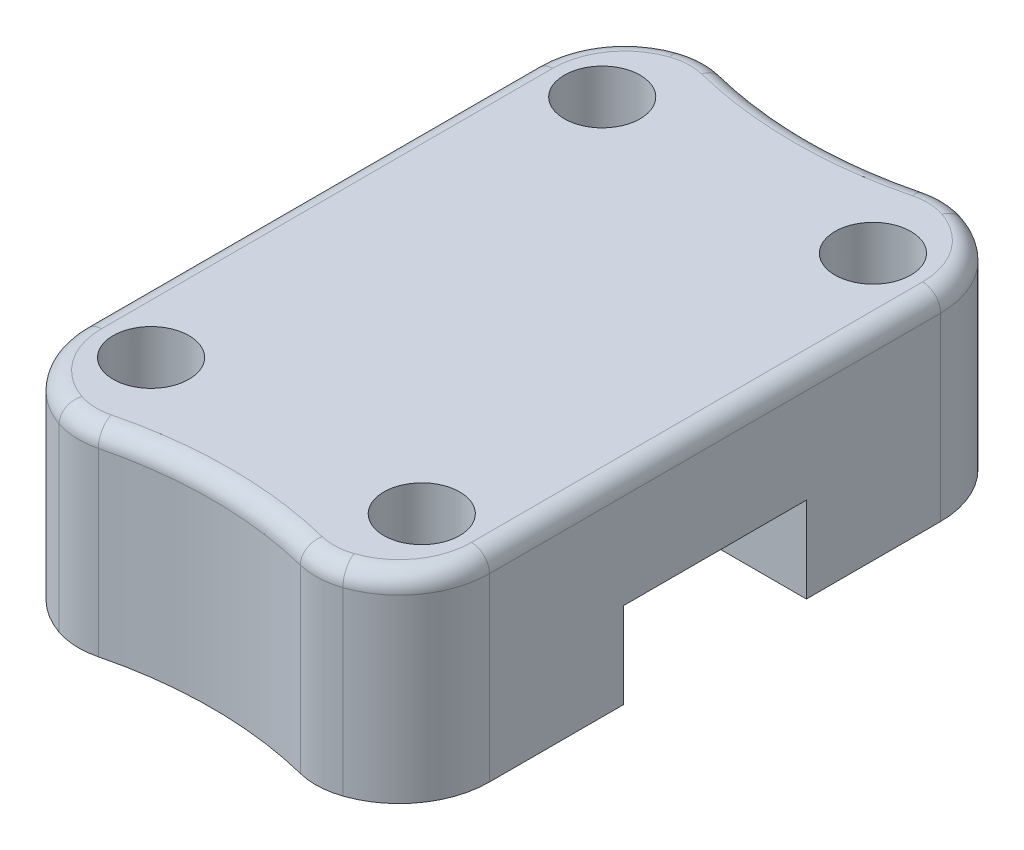
ISO-10303-21;
HEADER;
FILE_DESCRIPTION(('STEP AP214'),'2;1');
FILE_NAME('part.step','',(''),(''),'','','');
FILE_SCHEMA(('AUTOMOTIVE_DESIGN { 1 0 10303 214 1 1 1 1 }'));
ENDSEC;
DATA;
#1=APPLICATION_CONTEXT('core data for automotive mechanical design processes');
#2=APPLICATION_PROTOCOL_DEFINITION('international standard','automotive_design',2000,#1);
#3=PRODUCT_CONTEXT('',#1,'mechanical');
#4=PRODUCT('Part','Part','',(#3));
#5=PRODUCT_RELATED_PRODUCT_CATEGORY('part','',(#4));
#6=PRODUCT_DEFINITION_FORMATION('','',#4);
#7=PRODUCT_DEFINITION_CONTEXT('part definition',#1,'design');
#8=PRODUCT_DEFINITION('design','',#6,#7);
#9=PRODUCT_DEFINITION_SHAPE('','',#8);
#10=(LENGTH_UNIT() NAMED_UNIT(*) SI_UNIT(.MILLI.,.METRE.));
#11=(NAMED_UNIT(*) PLANE_ANGLE_UNIT() SI_UNIT($,.RADIAN.));
#12=(NAMED_UNIT(*) SI_UNIT($,.STERADIAN.) SOLID_ANGLE_UNIT());
#13=UNCERTAINTY_MEASURE_WITH_UNIT(LENGTH_MEASURE(1.E-05),#10,'distance_accuracy_value','');
#14=(GEOMETRIC_REPRESENTATION_CONTEXT(3) GLOBAL_UNCERTAINTY_ASSIGNED_CONTEXT((#13)) GLOBAL_UNIT_ASSIGNED_CONTEXT((#10,
#11,#12)) REPRESENTATION_CONTEXT('',''));
#15=CARTESIAN_POINT('',(0.,0.,0.));
#16=DIRECTION('',(0.,0.,1.));
#17=DIRECTION('',(1.,0.,0.));
#18=AXIS2_PLACEMENT_3D('',#15,#16,#17);
#19=CARTESIAN_POINT('',(0.,0.,0.));
#20=DIRECTION('',(0.,1.,0.));
#21=DIRECTION('',(0.,0.,1.));
#22=AXIS2_PLACEMENT_3D('',#19,#20,#21);
#23=PLANE('',#22);
#24=CARTESIAN_POINT('',(-15.,0.,25.));
#25=DIRECTION('',(0.,1.,0.));
#26=DIRECTION('',(0.,0.,1.));
#27=AXIS2_PLACEMENT_3D('',#24,#25,#26);
#28=CIRCLE('',#27,4.7);
#29=CARTESIAN_POINT('',(-15.,0.,29.7));
#30=VERTEX_POINT('',#29);
#31=EDGE_CURVE('E361',#30,#30,#28,.T.);
#32=ORIENTED_EDGE('',*,*,#31,.T.);
#33=EDGE_LOOP('',(#32));
#34=FACE_BOUND('',#33,.T.);
#35=CARTESIAN_POINT('',(15.,0.,25.));
#36=DIRECTION('',(0.,1.,0.));
#37=DIRECTION('',(0.,0.,1.));
#38=AXIS2_PLACEMENT_3D('',#35,#36,#37);
#39=CIRCLE('',#38,4.7);
#40=CARTESIAN_POINT('',(15.,0.,29.7));
#41=VERTEX_POINT('',#40);
#42=EDGE_CURVE('E358',#41,#41,#39,.T.);
#43=ORIENTED_EDGE('',*,*,#42,.T.);
#44=EDGE_LOOP('',(#43));
#45=FACE_BOUND('',#44,.T.);
#46=CARTESIAN_POINT('',(12.5,0.,25.));
#47=DIRECTION('',(0.,1.,0.));
#48=DIRECTION('',(0.,0.,1.));
#49=AXIS2_PLACEMENT_3D('',#46,#47,#48);
#50=CIRCLE('',#49,10.);
#51=CARTESIAN_POINT('',(22.5,0.,25.));
#52=VERTEX_POINT('',#51);
#53=CARTESIAN_POINT('',(15.7226987115137,0.,34.46647838506));
#54=VERTEX_POINT('',#53);
#55=EDGE_CURVE('E228',#52,#54,#50,.F.);
#56=ORIENTED_EDGE('',*,*,#55,.T.);
#57=CARTESIAN_POINT('',(13.1445397423027,0.,26.893295677012));
#58=DIRECTION('',(0.,1.,0.));
#59=DIRECTION('',(0.,0.,1.));
#60=AXIS2_PLACEMENT_3D('',#57,#58,#59);
#61=CIRCLE('',#60,8.);
#62=CARTESIAN_POINT('',(11.1972005212209,0.,34.6526687159911));
#63=VERTEX_POINT('',#62);
#64=EDGE_CURVE('E254',#54,#63,#61,.F.);
#65=ORIENTED_EDGE('',*,*,#64,.T.);
#66=CARTESIAN_POINT('',(0.,0.,79.2690636901211));
#67=DIRECTION('',(0.,-1.,0.));
#68=DIRECTION('',(0.,0.,1.));
#69=AXIS2_PLACEMENT_3D('',#66,#67,#68);
#70=CIRCLE('',#69,46.);
#71=CARTESIAN_POINT('',(-11.1972005212208,0.,34.6526687159911));
#72=VERTEX_POINT('',#71);
#73=EDGE_CURVE('E355',#72,#63,#70,.T.);
#74=ORIENTED_EDGE('',*,*,#73,.F.);
#75=CARTESIAN_POINT('',(-13.1445397423027,0.,26.893295677012));
#76=DIRECTION('',(0.,1.,0.));
#77=DIRECTION('',(0.,0.,1.));
#78=AXIS2_PLACEMENT_3D('',#75,#76,#77);
#79=CIRCLE('',#78,8.);
#80=CARTESIAN_POINT('',(-15.7226987115136,0.,34.46647838506));
#81=VERTEX_POINT('',#80);
#82=EDGE_CURVE('E252',#72,#81,#79,.F.);
#83=ORIENTED_EDGE('',*,*,#82,.T.);
#84=CARTESIAN_POINT('',(-12.5,0.,25.));
#85=DIRECTION('',(0.,1.,0.));
#86=DIRECTION('',(0.,0.,1.));
#87=AXIS2_PLACEMENT_3D('',#84,#85,#86);
#88=CIRCLE('',#87,10.);
#89=CARTESIAN_POINT('',(-22.5,0.,25.));
#90=VERTEX_POINT('',#89);
#91=EDGE_CURVE('E215',#81,#90,#88,.F.);
#92=ORIENTED_EDGE('',*,*,#91,.T.);
#93=DIRECTION('',(0.,0.,1.));
#94=VECTOR('',#93,1.);
#95=CARTESIAN_POINT('',(-22.5,0.,35.));
#96=LINE('',#95,#94);
#97=CARTESIAN_POINT('',(-22.5,0.,10.125));
#98=VERTEX_POINT('',#97);
#99=EDGE_CURVE('E207',#98,#90,#96,.T.);
#100=ORIENTED_EDGE('',*,*,#99,.F.);
#101=DIRECTION('',(1.,0.,0.));
#102=VECTOR('',#101,1.);
#103=CARTESIAN_POINT('',(-22.5,0.,10.125));
#104=LINE('',#103,#102);
#105=CARTESIAN_POINT('',(22.5,0.,10.125));
#106=VERTEX_POINT('',#105);
#107=EDGE_CURVE('E190',#98,#106,#104,.T.);
#108=ORIENTED_EDGE('',*,*,#107,.T.);
#109=DIRECTION('',(0.,0.,-1.));
#110=VECTOR('',#109,1.);
#111=CARTESIAN_POINT('',(22.5,0.,35.));
#112=LINE('',#111,#110);
#113=EDGE_CURVE('E223',#52,#106,#112,.T.);
#114=ORIENTED_EDGE('',*,*,#113,.F.);
#115=EDGE_LOOP('',(#56,#65,#74,#83,#92,#100,#108,#114));
#116=FACE_BOUND('',#115,.T.);
#117=ADVANCED_FACE('F37',(#34,#45,#116),#23,.F.);
#118=CARTESIAN_POINT('',(-22.5,22.,35.));
#119=DIRECTION('',(1.,0.,0.));
#120=DIRECTION('',(0.,0.,-1.));
#121=AXIS2_PLACEMENT_3D('',#118,#119,#120);
#122=PLANE('',#121);
#123=DIRECTION('',(0.,-1.,0.));
#124=VECTOR('',#123,1.);
#125=CARTESIAN_POINT('',(-22.5,22.,25.));
#126=LINE('',#125,#124);
#127=CARTESIAN_POINT('',(-22.5,20.,25.));
#128=VERTEX_POINT('',#127);
#129=EDGE_CURVE('E233',#90,#128,#126,.F.);
#130=ORIENTED_EDGE('',*,*,#129,.T.);
#131=DIRECTION('',(0.,0.,1.));
#132=VECTOR('',#131,1.);
#133=CARTESIAN_POINT('',(-22.5,20.,-25.));
#134=LINE('',#133,#132);
#135=CARTESIAN_POINT('',(-22.5,20.,-25.));
#136=VERTEX_POINT('',#135);
#137=EDGE_CURVE('E318',#128,#136,#134,.F.);
#138=ORIENTED_EDGE('',*,*,#137,.T.);
#139=DIRECTION('',(0.,-1.,0.));
#140=VECTOR('',#139,1.);
#141=CARTESIAN_POINT('',(-22.5,22.,-25.));
#142=LINE('',#141,#140);
#143=CARTESIAN_POINT('',(-22.5,0.,-25.));
#144=VERTEX_POINT('',#143);
#145=EDGE_CURVE('E231',#136,#144,#142,.T.);
#146=ORIENTED_EDGE('',*,*,#145,.T.);
#147=CARTESIAN_POINT('',(-22.5,0.,-10.125));
#148=VERTEX_POINT('',#147);
#149=EDGE_CURVE('E216',#144,#148,#96,.T.);
#150=ORIENTED_EDGE('',*,*,#149,.T.);
#151=DIRECTION('',(0.,1.,0.));
#152=VECTOR('',#151,1.);
#153=CARTESIAN_POINT('',(-22.5,9.50000000000001,-10.125));
#154=LINE('',#153,#152);
#155=CARTESIAN_POINT('',(-22.5,9.50000000000001,-10.125));
#156=VERTEX_POINT('',#155);
#157=EDGE_CURVE('E210',#148,#156,#154,.T.);
#158=ORIENTED_EDGE('',*,*,#157,.T.);
#159=DIRECTION('',(0.,0.,1.));
#160=VECTOR('',#159,1.);
#161=CARTESIAN_POINT('',(-22.5,9.50000000000001,-10.125));
#162=LINE('',#161,#160);
#163=CARTESIAN_POINT('',(-22.5,9.5,10.125));
#164=VERTEX_POINT('',#163);
#165=EDGE_CURVE('E202',#156,#164,#162,.T.);
#166=ORIENTED_EDGE('',*,*,#165,.T.);
#167=DIRECTION('',(0.,-1.,0.));
#168=VECTOR('',#167,1.);
#169=CARTESIAN_POINT('',(-22.5,9.5,10.125));
#170=LINE('',#169,#168);
#171=EDGE_CURVE('E194',#164,#98,#170,.T.);
#172=ORIENTED_EDGE('',*,*,#171,.T.);
#173=ORIENTED_EDGE('',*,*,#99,.T.);
#174=EDGE_LOOP('',(#130,#138,#146,#150,#158,#166,#172,#173));
#175=FACE_BOUND('',#174,.T.);
#176=ADVANCED_FACE('F206',(#175),#122,.F.);
#177=CARTESIAN_POINT('',(22.5,22.,35.));
#178=DIRECTION('',(-1.,0.,0.));
#179=DIRECTION('',(0.,0.,1.));
#180=AXIS2_PLACEMENT_3D('',#177,#178,#179);
#181=PLANE('',#180);
#182=DIRECTION('',(0.,-1.,0.));
#183=VECTOR('',#182,1.);
#184=CARTESIAN_POINT('',(22.5,22.,-25.));
#185=LINE('',#184,#183);
#186=CARTESIAN_POINT('',(22.5,0.,-25.));
#187=VERTEX_POINT('',#186);
#188=CARTESIAN_POINT('',(22.5,20.,-25.));
#189=VERTEX_POINT('',#188);
#190=EDGE_CURVE('E235',#187,#189,#185,.F.);
#191=ORIENTED_EDGE('',*,*,#190,.T.);
#192=DIRECTION('',(0.,0.,-1.));
#193=VECTOR('',#192,1.);
#194=CARTESIAN_POINT('',(22.5,20.,25.));
#195=LINE('',#194,#193);
#196=CARTESIAN_POINT('',(22.5,20.,25.));
#197=VERTEX_POINT('',#196);
#198=EDGE_CURVE('E308',#189,#197,#195,.F.);
#199=ORIENTED_EDGE('',*,*,#198,.T.);
#200=DIRECTION('',(0.,-1.,0.));
#201=VECTOR('',#200,1.);
#202=CARTESIAN_POINT('',(22.5,22.,25.));
#203=LINE('',#202,#201);
#204=EDGE_CURVE('E238',#197,#52,#203,.T.);
#205=ORIENTED_EDGE('',*,*,#204,.T.);
#206=ORIENTED_EDGE('',*,*,#113,.T.);
#207=DIRECTION('',(0.,1.,0.));
#208=VECTOR('',#207,1.);
#209=CARTESIAN_POINT('',(22.5,22.,10.125));
#210=LINE('',#209,#208);
#211=CARTESIAN_POINT('',(22.5,9.5,10.125));
#212=VERTEX_POINT('',#211);
#213=EDGE_CURVE('E197',#106,#212,#210,.T.);
#214=ORIENTED_EDGE('',*,*,#213,.T.);
#215=DIRECTION('',(0.,0.,-1.));
#216=VECTOR('',#215,1.);
#217=CARTESIAN_POINT('',(22.5,9.5,35.));
#218=LINE('',#217,#216);
#219=CARTESIAN_POINT('',(22.5,9.50000000000001,-10.125));
#220=VERTEX_POINT('',#219);
#221=EDGE_CURVE('E225',#212,#220,#218,.T.);
#222=ORIENTED_EDGE('',*,*,#221,.T.);
#223=DIRECTION('',(0.,-1.,0.));
#224=VECTOR('',#223,1.);
#225=CARTESIAN_POINT('',(22.5,22.,-10.125));
#226=LINE('',#225,#224);
#227=CARTESIAN_POINT('',(22.5,0.,-10.125));
#228=VERTEX_POINT('',#227);
#229=EDGE_CURVE('E219',#220,#228,#226,.T.);
#230=ORIENTED_EDGE('',*,*,#229,.T.);
#231=EDGE_CURVE('E218',#228,#187,#112,.T.);
#232=ORIENTED_EDGE('',*,*,#231,.T.);
#233=EDGE_LOOP('',(#191,#199,#205,#206,#214,#222,#230,#232));
#234=FACE_BOUND('',#233,.T.);
#235=ADVANCED_FACE('F413',(#234),#181,.F.);
#236=CARTESIAN_POINT('',(0.,22.,0.));
#237=DIRECTION('',(0.,1.,0.));
#238=DIRECTION('',(0.,0.,1.));
#239=AXIS2_PLACEMENT_3D('',#236,#237,#238);
#240=PLANE('',#239);
#241=CARTESIAN_POINT('',(-13.1445397423027,22.,-26.893295677012));
#242=DIRECTION('',(0.,1.,0.));
#243=DIRECTION('',(0.,0.,1.));
#244=AXIS2_PLACEMENT_3D('',#241,#242,#243);
#245=CIRCLE('',#244,6.);
#246=CARTESIAN_POINT('',(-11.6840353264913,22.,-32.7128254562464));
#247=VERTEX_POINT('',#246);
#248=CARTESIAN_POINT('',(-15.0781589692109,22.,-32.573182708048));
#249=VERTEX_POINT('',#248);
#250=EDGE_CURVE('E292',#247,#249,#245,.T.);
#251=ORIENTED_EDGE('',*,*,#250,.T.);
#252=CARTESIAN_POINT('',(-12.5,22.,-25.));
#253=DIRECTION('',(0.,1.,0.));
#254=DIRECTION('',(0.,0.,1.));
#255=AXIS2_PLACEMENT_3D('',#252,#253,#254);
#256=CIRCLE('',#255,8.);
#257=CARTESIAN_POINT('',(-20.5,22.,-25.));
#258=VERTEX_POINT('',#257);
#259=EDGE_CURVE('E294',#249,#258,#256,.T.);
#260=ORIENTED_EDGE('',*,*,#259,.T.);
#261=DIRECTION('',(0.,0.,1.));
#262=VECTOR('',#261,1.);
#263=CARTESIAN_POINT('',(-20.5,22.,25.));
#264=LINE('',#263,#262);
#265=CARTESIAN_POINT('',(-20.5,22.,25.));
#266=VERTEX_POINT('',#265);
#267=EDGE_CURVE('E272',#258,#266,#264,.T.);
#268=ORIENTED_EDGE('',*,*,#267,.T.);
#269=CARTESIAN_POINT('',(-12.5,22.,25.));
#270=DIRECTION('',(0.,1.,0.));
#271=DIRECTION('',(0.,0.,1.));
#272=AXIS2_PLACEMENT_3D('',#269,#270,#271);
#273=CIRCLE('',#272,8.);
#274=CARTESIAN_POINT('',(-15.0781589692109,22.,32.573182708048));
#275=VERTEX_POINT('',#274);
#276=EDGE_CURVE('E274',#266,#275,#273,.T.);
#277=ORIENTED_EDGE('',*,*,#276,.T.);
#278=CARTESIAN_POINT('',(-13.1445397423027,22.,26.893295677012));
#279=DIRECTION('',(0.,1.,0.));
#280=DIRECTION('',(0.,0.,1.));
#281=AXIS2_PLACEMENT_3D('',#278,#279,#280);
#282=CIRCLE('',#281,6.);
#283=CARTESIAN_POINT('',(-11.6840353264913,22.,32.7128254562464));
#284=VERTEX_POINT('',#283);
#285=EDGE_CURVE('E276',#275,#284,#282,.T.);
#286=ORIENTED_EDGE('',*,*,#285,.T.);
#287=CARTESIAN_POINT('',(0.,22.,79.2690636901211));
#288=DIRECTION('',(0.,1.,0.));
#289=DIRECTION('',(0.,0.,1.));
#290=AXIS2_PLACEMENT_3D('',#287,#288,#289);
#291=CIRCLE('',#290,48.);
#292=CARTESIAN_POINT('',(11.6840353264913,22.,32.7128254562463));
#293=VERTEX_POINT('',#292);
#294=EDGE_CURVE('E278',#284,#293,#291,.F.);
#295=ORIENTED_EDGE('',*,*,#294,.T.);
#296=CARTESIAN_POINT('',(13.1445397423027,22.,26.893295677012));
#297=DIRECTION('',(0.,1.,0.));
#298=DIRECTION('',(0.,0.,1.));
#299=AXIS2_PLACEMENT_3D('',#296,#297,#298);
#300=CIRCLE('',#299,6.);
#301=CARTESIAN_POINT('',(15.0781589692109,22.,32.573182708048));
#302=VERTEX_POINT('',#301);
#303=EDGE_CURVE('E280',#293,#302,#300,.T.);
#304=ORIENTED_EDGE('',*,*,#303,.T.);
#305=CARTESIAN_POINT('',(12.5,22.,25.));
#306=DIRECTION('',(0.,1.,0.));
#307=DIRECTION('',(0.,0.,1.));
#308=AXIS2_PLACEMENT_3D('',#305,#306,#307);
#309=CIRCLE('',#308,8.);
#310=CARTESIAN_POINT('',(20.5,22.,25.));
#311=VERTEX_POINT('',#310);
#312=EDGE_CURVE('E282',#302,#311,#309,.T.);
#313=ORIENTED_EDGE('',*,*,#312,.T.);
#314=DIRECTION('',(0.,0.,-1.));
#315=VECTOR('',#314,1.);
#316=CARTESIAN_POINT('',(20.5,22.,-25.));
#317=LINE('',#316,#315);
#318=CARTESIAN_POINT('',(20.5,22.,-25.));
#319=VERTEX_POINT('',#318);
#320=EDGE_CURVE('E284',#311,#319,#317,.T.);
#321=ORIENTED_EDGE('',*,*,#320,.T.);
#322=CARTESIAN_POINT('',(12.5,22.,-25.));
#323=DIRECTION('',(0.,1.,0.));
#324=DIRECTION('',(0.,0.,1.));
#325=AXIS2_PLACEMENT_3D('',#322,#323,#324);
#326=CIRCLE('',#325,8.);
#327=CARTESIAN_POINT('',(15.0781589692109,22.,-32.573182708048));
#328=VERTEX_POINT('',#327);
#329=EDGE_CURVE('E286',#319,#328,#326,.T.);
#330=ORIENTED_EDGE('',*,*,#329,.T.);
#331=CARTESIAN_POINT('',(13.1445397423027,22.,-26.893295677012));
#332=DIRECTION('',(0.,1.,0.));
#333=DIRECTION('',(0.,0.,1.));
#334=AXIS2_PLACEMENT_3D('',#331,#332,#333);
#335=CIRCLE('',#334,6.);
#336=CARTESIAN_POINT('',(11.6840353264913,22.,-32.7128254562464));
#337=VERTEX_POINT('',#336);
#338=EDGE_CURVE('E288',#328,#337,#335,.T.);
#339=ORIENTED_EDGE('',*,*,#338,.T.);
#340=CARTESIAN_POINT('',(0.,22.,-79.2690636901211));
#341=DIRECTION('',(0.,1.,0.));
#342=DIRECTION('',(0.,0.,1.));
#343=AXIS2_PLACEMENT_3D('',#340,#341,#342);
#344=CIRCLE('',#343,48.);
#345=EDGE_CURVE('E290',#337,#247,#344,.F.);
#346=ORIENTED_EDGE('',*,*,#345,.T.);
#347=EDGE_LOOP('',(#251,#260,#268,#277,#286,#295,#304,#313,#321,#330,#339,#346));
#348=FACE_BOUND('',#347,.T.);
#349=CARTESIAN_POINT('',(-15.,22.,25.));
#350=DIRECTION('',(0.,-1.,0.));
#351=DIRECTION('',(0.,0.,-1.));
#352=AXIS2_PLACEMENT_3D('',#349,#350,#351);
#353=CIRCLE('',#352,4.2);
#354=CARTESIAN_POINT('',(-15.,22.,20.8));
#355=VERTEX_POINT('',#354);
#356=EDGE_CURVE('E393',#355,#355,#353,.T.);
#357=ORIENTED_EDGE('',*,*,#356,.T.);
#358=EDGE_LOOP('',(#357));
#359=FACE_BOUND('',#358,.T.);
#360=CARTESIAN_POINT('',(15.,22.,25.));
#361=DIRECTION('',(0.,-1.,0.));
#362=DIRECTION('',(0.,0.,-1.));
#363=AXIS2_PLACEMENT_3D('',#360,#361,#362);
#364=CIRCLE('',#363,4.2);
#365=CARTESIAN_POINT('',(15.,22.,20.8));
#366=VERTEX_POINT('',#365);
#367=EDGE_CURVE('E396',#366,#366,#364,.T.);
#368=ORIENTED_EDGE('',*,*,#367,.T.);
#369=EDGE_LOOP('',(#368));
#370=FACE_BOUND('',#369,.T.);
#371=CARTESIAN_POINT('',(15.,22.,-25.));
#372=DIRECTION('',(0.,-1.,0.));
#373=DIRECTION('',(0.,0.,-1.));
#374=AXIS2_PLACEMENT_3D('',#371,#372,#373);
#375=CIRCLE('',#374,4.2);
#376=CARTESIAN_POINT('',(15.,22.,-29.2));
#377=VERTEX_POINT('',#376);
#378=EDGE_CURVE('E399',#377,#377,#375,.T.);
#379=ORIENTED_EDGE('',*,*,#378,.T.);
#380=EDGE_LOOP('',(#379));
#381=FACE_BOUND('',#380,.T.);
#382=CARTESIAN_POINT('',(-15.,22.,-25.));
#383=DIRECTION('',(0.,-1.,0.));
#384=DIRECTION('',(0.,0.,-1.));
#385=AXIS2_PLACEMENT_3D('',#382,#383,#384);
#386=CIRCLE('',#385,4.2);
#387=CARTESIAN_POINT('',(-15.,22.,-29.2));
#388=VERTEX_POINT('',#387);
#389=EDGE_CURVE('E211',#388,#388,#386,.T.);
#390=ORIENTED_EDGE('',*,*,#389,.T.);
#391=EDGE_LOOP('',(#390));
#392=FACE_BOUND('',#391,.T.);
#393=ADVANCED_FACE('F442',(#348,#359,#370,#381,#392),#240,.T.);
#394=CARTESIAN_POINT('',(-15.,0.,-25.));
#395=DIRECTION('',(0.,1.,0.));
#396=DIRECTION('',(0.,0.,1.));
#397=AXIS2_PLACEMENT_3D('',#394,#395,#396);
#398=CIRCLE('',#397,4.7);
#399=CARTESIAN_POINT('',(-15.,0.,-20.3));
#400=VERTEX_POINT('',#399);
#401=EDGE_CURVE('E45',#400,#400,#398,.T.);
#402=ORIENTED_EDGE('',*,*,#401,.T.);
#403=EDGE_LOOP('',(#402));
#404=FACE_BOUND('',#403,.T.);
#405=CARTESIAN_POINT('',(15.,0.,-25.));
#406=DIRECTION('',(0.,1.,0.));
#407=DIRECTION('',(0.,0.,1.));
#408=AXIS2_PLACEMENT_3D('',#405,#406,#407);
#409=CIRCLE('',#408,4.7);
#410=CARTESIAN_POINT('',(15.,0.,-20.3));
#411=VERTEX_POINT('',#410);
#412=EDGE_CURVE('E370',#411,#411,#409,.T.);
#413=ORIENTED_EDGE('',*,*,#412,.T.);
#414=EDGE_LOOP('',(#413));
#415=FACE_BOUND('',#414,.T.);
#416=CARTESIAN_POINT('',(-12.5,0.,-25.));
#417=DIRECTION('',(0.,1.,0.));
#418=DIRECTION('',(0.,0.,1.));
#419=AXIS2_PLACEMENT_3D('',#416,#417,#418);
#420=CIRCLE('',#419,10.);
#421=CARTESIAN_POINT('',(-15.7226987115136,0.,-34.46647838506));
#422=VERTEX_POINT('',#421);
#423=EDGE_CURVE('E242',#144,#422,#420,.F.);
#424=ORIENTED_EDGE('',*,*,#423,.T.);
#425=CARTESIAN_POINT('',(-13.1445397423027,0.,-26.893295677012));
#426=DIRECTION('',(0.,1.,0.));
#427=DIRECTION('',(0.,0.,1.));
#428=AXIS2_PLACEMENT_3D('',#425,#426,#427);
#429=CIRCLE('',#428,8.);
#430=CARTESIAN_POINT('',(-11.1972005212208,0.,-34.6526687159911));
#431=VERTEX_POINT('',#430);
#432=EDGE_CURVE('E267',#422,#431,#429,.F.);
#433=ORIENTED_EDGE('',*,*,#432,.T.);
#434=CARTESIAN_POINT('',(0.,0.,-79.2690636901211));
#435=DIRECTION('',(0.,-1.,0.));
#436=DIRECTION('',(0.,0.,-1.));
#437=AXIS2_PLACEMENT_3D('',#434,#435,#436);
#438=CIRCLE('',#437,46.);
#439=CARTESIAN_POINT('',(11.1972005212209,0.,-34.6526687159911));
#440=VERTEX_POINT('',#439);
#441=EDGE_CURVE('E475',#440,#431,#438,.T.);
#442=ORIENTED_EDGE('',*,*,#441,.F.);
#443=CARTESIAN_POINT('',(13.1445397423027,0.,-26.893295677012));
#444=DIRECTION('',(0.,1.,0.));
#445=DIRECTION('',(0.,0.,1.));
#446=AXIS2_PLACEMENT_3D('',#443,#444,#445);
#447=CIRCLE('',#446,8.);
#448=CARTESIAN_POINT('',(15.7226987115136,0.,-34.46647838506));
#449=VERTEX_POINT('',#448);
#450=EDGE_CURVE('E265',#440,#449,#447,.F.);
#451=ORIENTED_EDGE('',*,*,#450,.T.);
#452=CARTESIAN_POINT('',(12.5,0.,-25.));
#453=DIRECTION('',(0.,1.,0.));
#454=DIRECTION('',(0.,0.,1.));
#455=AXIS2_PLACEMENT_3D('',#452,#453,#454);
#456=CIRCLE('',#455,10.);
#457=EDGE_CURVE('E240',#449,#187,#456,.F.);
#458=ORIENTED_EDGE('',*,*,#457,.T.);
#459=ORIENTED_EDGE('',*,*,#231,.F.);
#460=DIRECTION('',(1.,0.,0.));
#461=VECTOR('',#460,1.);
#462=CARTESIAN_POINT('',(-22.5,0.,-10.125));
#463=LINE('',#462,#461);
#464=EDGE_CURVE('E201',#148,#228,#463,.T.);
#465=ORIENTED_EDGE('',*,*,#464,.F.);
#466=ORIENTED_EDGE('',*,*,#149,.F.);
#467=EDGE_LOOP('',(#424,#433,#442,#451,#458,#459,#465,#466));
#468=FACE_BOUND('',#467,.T.);
#469=ADVANCED_FACE('F375',(#404,#415,#468),#23,.F.);
#470=CARTESIAN_POINT('',(-22.5,9.50000000000001,-10.125));
#471=DIRECTION('',(0.,1.,0.));
#472=DIRECTION('',(0.,0.,1.));
#473=AXIS2_PLACEMENT_3D('',#470,#471,#472);
#474=PLANE('',#473);
#475=DIRECTION('',(1.,0.,0.));
#476=VECTOR('',#475,1.);
#477=CARTESIAN_POINT('',(-22.5,9.5,10.125));
#478=LINE('',#477,#476);
#479=EDGE_CURVE('E404',#164,#212,#478,.T.);
#480=ORIENTED_EDGE('',*,*,#479,.F.);
#481=ORIENTED_EDGE('',*,*,#165,.F.);
#482=DIRECTION('',(1.,0.,0.));
#483=VECTOR('',#482,1.);
#484=CARTESIAN_POINT('',(-22.5,9.50000000000001,-10.125));
#485=LINE('',#484,#483);
#486=EDGE_CURVE('E406',#156,#220,#485,.T.);
#487=ORIENTED_EDGE('',*,*,#486,.T.);
#488=ORIENTED_EDGE('',*,*,#221,.F.);
#489=EDGE_LOOP('',(#480,#481,#487,#488));
#490=FACE_BOUND('',#489,.T.);
#491=ADVANCED_FACE('F507',(#490),#474,.F.);
#492=CARTESIAN_POINT('',(-22.5,9.5,10.125));
#493=DIRECTION('',(0.,0.,1.));
#494=DIRECTION('',(0.,-1.,0.));
#495=AXIS2_PLACEMENT_3D('',#492,#493,#494);
#496=PLANE('',#495);
#497=ORIENTED_EDGE('',*,*,#107,.F.);
#498=ORIENTED_EDGE('',*,*,#171,.F.);
#499=ORIENTED_EDGE('',*,*,#479,.T.);
#500=ORIENTED_EDGE('',*,*,#213,.F.);
#501=EDGE_LOOP('',(#497,#498,#499,#500));
#502=FACE_BOUND('',#501,.T.);
#503=ADVANCED_FACE('F192',(#502),#496,.F.);
#504=CARTESIAN_POINT('',(-22.5,9.50000000000001,-10.125));
#505=DIRECTION('',(0.,0.,-1.));
#506=DIRECTION('',(0.,1.,0.));
#507=AXIS2_PLACEMENT_3D('',#504,#505,#506);
#508=PLANE('',#507);
#509=ORIENTED_EDGE('',*,*,#486,.F.);
#510=ORIENTED_EDGE('',*,*,#157,.F.);
#511=ORIENTED_EDGE('',*,*,#464,.T.);
#512=ORIENTED_EDGE('',*,*,#229,.F.);
#513=EDGE_LOOP('',(#509,#510,#511,#512));
#514=FACE_BOUND('',#513,.T.);
#515=ADVANCED_FACE('F388',(#514),#508,.F.);
#516=CARTESIAN_POINT('',(-15.,22.,-25.));
#517=DIRECTION('',(0.,-1.,0.));
#518=DIRECTION('',(0.,0.,-1.));
#519=AXIS2_PLACEMENT_3D('',#516,#517,#518);
#520=CYLINDRICAL_SURFACE('',#519,4.2);
#521=CARTESIAN_POINT('',(-15.,1.3737387097273,-25.));
#522=DIRECTION('',(0.,1.,0.));
#523=DIRECTION('',(0.,0.,1.));
#524=AXIS2_PLACEMENT_3D('',#521,#522,#523);
#525=CIRCLE('',#524,4.2);
#526=CARTESIAN_POINT('',(-15.,1.3737387097273,-20.8));
#527=VERTEX_POINT('',#526);
#528=EDGE_CURVE('E367',#527,#527,#525,.F.);
#529=ORIENTED_EDGE('',*,*,#528,.T.);
#530=EDGE_LOOP('',(#529));
#531=FACE_BOUND('',#530,.T.);
#532=ORIENTED_EDGE('',*,*,#389,.F.);
#533=EDGE_LOOP('',(#532));
#534=FACE_BOUND('',#533,.T.);
#535=ADVANCED_FACE('F384',(#531,#534),#520,.F.);
#536=CARTESIAN_POINT('',(15.,22.,-25.));
#537=DIRECTION('',(0.,-1.,0.));
#538=DIRECTION('',(0.,0.,-1.));
#539=AXIS2_PLACEMENT_3D('',#536,#537,#538);
#540=CYLINDRICAL_SURFACE('',#539,4.2);
#541=CARTESIAN_POINT('',(15.,1.37373870972732,-25.));
#542=DIRECTION('',(0.,1.,0.));
#543=DIRECTION('',(0.,0.,1.));
#544=AXIS2_PLACEMENT_3D('',#541,#542,#543);
#545=CIRCLE('',#544,4.2);
#546=CARTESIAN_POINT('',(15.,1.37373870972732,-20.8));
#547=VERTEX_POINT('',#546);
#548=EDGE_CURVE('E11',#547,#547,#545,.F.);
#549=ORIENTED_EDGE('',*,*,#548,.T.);
#550=EDGE_LOOP('',(#549));
#551=FACE_BOUND('',#550,.T.);
#552=ORIENTED_EDGE('',*,*,#378,.F.);
#553=EDGE_LOOP('',(#552));
#554=FACE_BOUND('',#553,.T.);
#555=ADVANCED_FACE('F387',(#551,#554),#540,.F.);
#556=CARTESIAN_POINT('',(15.,22.,25.));
#557=DIRECTION('',(0.,-1.,0.));
#558=DIRECTION('',(0.,0.,-1.));
#559=AXIS2_PLACEMENT_3D('',#556,#557,#558);
#560=CYLINDRICAL_SURFACE('',#559,4.2);
#561=CARTESIAN_POINT('',(15.,1.37373870972729,25.));
#562=DIRECTION('',(0.,1.,0.));
#563=DIRECTION('',(0.,0.,1.));
#564=AXIS2_PLACEMENT_3D('',#561,#562,#563);
#565=CIRCLE('',#564,4.2);
#566=CARTESIAN_POINT('',(15.,1.37373870972729,29.2));
#567=VERTEX_POINT('',#566);
#568=EDGE_CURVE('E364',#567,#567,#565,.F.);
#569=ORIENTED_EDGE('',*,*,#568,.T.);
#570=EDGE_LOOP('',(#569));
#571=FACE_BOUND('',#570,.T.);
#572=ORIENTED_EDGE('',*,*,#367,.F.);
#573=EDGE_LOOP('',(#572));
#574=FACE_BOUND('',#573,.T.);
#575=ADVANCED_FACE('F487',(#571,#574),#560,.F.);
#576=CARTESIAN_POINT('',(-15.,22.,25.));
#577=DIRECTION('',(0.,-1.,0.));
#578=DIRECTION('',(0.,0.,-1.));
#579=AXIS2_PLACEMENT_3D('',#576,#577,#578);
#580=CYLINDRICAL_SURFACE('',#579,4.2);
#581=CARTESIAN_POINT('',(-15.,1.37373870972729,25.));
#582=DIRECTION('',(0.,1.,0.));
#583=DIRECTION('',(0.,0.,1.));
#584=AXIS2_PLACEMENT_3D('',#581,#582,#583);
#585=CIRCLE('',#584,4.2);
#586=CARTESIAN_POINT('',(-15.,1.37373870972729,29.2));
#587=VERTEX_POINT('',#586);
#588=EDGE_CURVE('E320',#587,#587,#585,.F.);
#589=ORIENTED_EDGE('',*,*,#588,.T.);
#590=EDGE_LOOP('',(#589));
#591=FACE_BOUND('',#590,.T.);
#592=ORIENTED_EDGE('',*,*,#356,.F.);
#593=EDGE_LOOP('',(#592));
#594=FACE_BOUND('',#593,.T.);
#595=ADVANCED_FACE('F493',(#591,#594),#580,.F.);
#596=CARTESIAN_POINT('',(-12.5,22.,25.));
#597=DIRECTION('',(0.,-1.,0.));
#598=DIRECTION('',(0.,0.,-1.));
#599=AXIS2_PLACEMENT_3D('',#596,#597,#598);
#600=CYLINDRICAL_SURFACE('',#599,10.);
#601=DIRECTION('',(0.,-1.,0.));
#602=VECTOR('',#601,1.);
#603=CARTESIAN_POINT('',(-15.7226987115136,22.,34.46647838506));
#604=LINE('',#603,#602);
#605=CARTESIAN_POINT('',(-15.7226987115136,20.,34.46647838506));
#606=VERTEX_POINT('',#605);
#607=EDGE_CURVE('E256',#81,#606,#604,.F.);
#608=ORIENTED_EDGE('',*,*,#607,.T.);
#609=CARTESIAN_POINT('',(-12.5,20.,25.));
#610=DIRECTION('',(0.,1.,0.));
#611=DIRECTION('',(0.,0.,1.));
#612=AXIS2_PLACEMENT_3D('',#609,#610,#611);
#613=CIRCLE('',#612,10.);
#614=EDGE_CURVE('E52',#606,#128,#613,.F.);
#615=ORIENTED_EDGE('',*,*,#614,.T.);
#616=ORIENTED_EDGE('',*,*,#129,.F.);
#617=ORIENTED_EDGE('',*,*,#91,.F.);
#618=EDGE_LOOP('',(#608,#615,#616,#617));
#619=FACE_BOUND('',#618,.T.);
#620=ADVANCED_FACE('F546',(#619),#600,.T.);
#621=CARTESIAN_POINT('',(12.5,22.,25.));
#622=DIRECTION('',(0.,-1.,0.));
#623=DIRECTION('',(0.,0.,-1.));
#624=AXIS2_PLACEMENT_3D('',#621,#622,#623);
#625=CYLINDRICAL_SURFACE('',#624,10.);
#626=ORIENTED_EDGE('',*,*,#204,.F.);
#627=CARTESIAN_POINT('',(12.5,20.,25.));
#628=DIRECTION('',(0.,1.,0.));
#629=DIRECTION('',(0.,0.,1.));
#630=AXIS2_PLACEMENT_3D('',#627,#628,#629);
#631=CIRCLE('',#630,10.);
#632=CARTESIAN_POINT('',(15.7226987115137,20.,34.46647838506));
#633=VERTEX_POINT('',#632);
#634=EDGE_CURVE('E310',#197,#633,#631,.F.);
#635=ORIENTED_EDGE('',*,*,#634,.T.);
#636=DIRECTION('',(0.,-1.,0.));
#637=VECTOR('',#636,1.);
#638=CARTESIAN_POINT('',(15.7226987115137,22.,34.46647838506));
#639=LINE('',#638,#637);
#640=EDGE_CURVE('E250',#633,#54,#639,.T.);
#641=ORIENTED_EDGE('',*,*,#640,.T.);
#642=ORIENTED_EDGE('',*,*,#55,.F.);
#643=EDGE_LOOP('',(#626,#635,#641,#642));
#644=FACE_BOUND('',#643,.T.);
#645=ADVANCED_FACE('F463',(#644),#625,.T.);
#646=CARTESIAN_POINT('',(-12.5,22.,-25.));
#647=DIRECTION('',(0.,-1.,0.));
#648=DIRECTION('',(0.,0.,-1.));
#649=AXIS2_PLACEMENT_3D('',#646,#647,#648);
#650=CYLINDRICAL_SURFACE('',#649,10.);
#651=ORIENTED_EDGE('',*,*,#145,.F.);
#652=CARTESIAN_POINT('',(-12.5,20.,-25.));
#653=DIRECTION('',(0.,1.,0.));
#654=DIRECTION('',(0.,0.,1.));
#655=AXIS2_PLACEMENT_3D('',#652,#653,#654);
#656=CIRCLE('',#655,10.);
#657=CARTESIAN_POINT('',(-15.7226987115136,20.,-34.46647838506));
#658=VERTEX_POINT('',#657);
#659=EDGE_CURVE('E297',#136,#658,#656,.F.);
#660=ORIENTED_EDGE('',*,*,#659,.T.);
#661=DIRECTION('',(0.,-1.,0.));
#662=VECTOR('',#661,1.);
#663=CARTESIAN_POINT('',(-15.7226987115136,22.,-34.46647838506));
#664=LINE('',#663,#662);
#665=EDGE_CURVE('E263',#658,#422,#664,.T.);
#666=ORIENTED_EDGE('',*,*,#665,.T.);
#667=ORIENTED_EDGE('',*,*,#423,.F.);
#668=EDGE_LOOP('',(#651,#660,#666,#667));
#669=FACE_BOUND('',#668,.T.);
#670=ADVANCED_FACE('F542',(#669),#650,.T.);
#671=CARTESIAN_POINT('',(12.5,22.,-25.));
#672=DIRECTION('',(0.,-1.,0.));
#673=DIRECTION('',(0.,0.,-1.));
#674=AXIS2_PLACEMENT_3D('',#671,#672,#673);
#675=CYLINDRICAL_SURFACE('',#674,10.);
#676=DIRECTION('',(0.,-1.,0.));
#677=VECTOR('',#676,1.);
#678=CARTESIAN_POINT('',(15.7226987115136,22.,-34.46647838506));
#679=LINE('',#678,#677);
#680=CARTESIAN_POINT('',(15.7226987115136,20.,-34.46647838506));
#681=VERTEX_POINT('',#680);
#682=EDGE_CURVE('E269',#449,#681,#679,.F.);
#683=ORIENTED_EDGE('',*,*,#682,.T.);
#684=CARTESIAN_POINT('',(12.5,20.,-25.));
#685=DIRECTION('',(0.,1.,0.));
#686=DIRECTION('',(0.,0.,1.));
#687=AXIS2_PLACEMENT_3D('',#684,#685,#686);
#688=CIRCLE('',#687,10.);
#689=EDGE_CURVE('E306',#681,#189,#688,.F.);
#690=ORIENTED_EDGE('',*,*,#689,.T.);
#691=ORIENTED_EDGE('',*,*,#190,.F.);
#692=ORIENTED_EDGE('',*,*,#457,.F.);
#693=EDGE_LOOP('',(#683,#690,#691,#692));
#694=FACE_BOUND('',#693,.T.);
#695=ADVANCED_FACE('F424',(#694),#675,.T.);
#696=CARTESIAN_POINT('',(0.,22.,-79.2690636901211));
#697=DIRECTION('',(0.,-1.,0.));
#698=DIRECTION('',(0.,0.,-1.));
#699=AXIS2_PLACEMENT_3D('',#696,#697,#698);
#700=CYLINDRICAL_SURFACE('',#699,46.);
#701=DIRECTION('',(0.,-1.,0.));
#702=VECTOR('',#701,1.);
#703=CARTESIAN_POINT('',(-11.1972005212208,22.,-34.6526687159911));
#704=LINE('',#703,#702);
#705=CARTESIAN_POINT('',(-11.1972005212208,20.,-34.6526687159911));
#706=VERTEX_POINT('',#705);
#707=EDGE_CURVE('E260',#431,#706,#704,.F.);
#708=ORIENTED_EDGE('',*,*,#707,.T.);
#709=CARTESIAN_POINT('',(0.,20.,-79.2690636901211));
#710=DIRECTION('',(0.,1.,0.));
#711=DIRECTION('',(0.,0.,1.));
#712=AXIS2_PLACEMENT_3D('',#709,#710,#711);
#713=CIRCLE('',#712,46.);
#714=CARTESIAN_POINT('',(11.1972005212208,20.,-34.6526687159911));
#715=VERTEX_POINT('',#714);
#716=EDGE_CURVE('E302',#706,#715,#713,.T.);
#717=ORIENTED_EDGE('',*,*,#716,.T.);
#718=DIRECTION('',(0.,-1.,0.));
#719=VECTOR('',#718,1.);
#720=CARTESIAN_POINT('',(11.1972005212208,22.,-34.6526687159911));
#721=LINE('',#720,#719);
#722=EDGE_CURVE('E258',#715,#440,#721,.T.);
#723=ORIENTED_EDGE('',*,*,#722,.T.);
#724=ORIENTED_EDGE('',*,*,#441,.T.);
#725=EDGE_LOOP('',(#708,#717,#723,#724));
#726=FACE_BOUND('',#725,.T.);
#727=ADVANCED_FACE('F534',(#726),#700,.F.);
#728=CARTESIAN_POINT('',(0.,22.,79.2690636901211));
#729=DIRECTION('',(0.,-1.,0.));
#730=DIRECTION('',(0.,0.,-1.));
#731=AXIS2_PLACEMENT_3D('',#728,#729,#730);
#732=CYLINDRICAL_SURFACE('',#731,46.);
#733=DIRECTION('',(0.,-1.,0.));
#734=VECTOR('',#733,1.);
#735=CARTESIAN_POINT('',(11.1972005212209,22.,34.6526687159911));
#736=LINE('',#735,#734);
#737=CARTESIAN_POINT('',(11.1972005212209,20.,34.6526687159911));
#738=VERTEX_POINT('',#737);
#739=EDGE_CURVE('E247',#63,#738,#736,.F.);
#740=ORIENTED_EDGE('',*,*,#739,.T.);
#741=CARTESIAN_POINT('',(0.,20.,79.2690636901211));
#742=DIRECTION('',(0.,1.,0.));
#743=DIRECTION('',(0.,0.,1.));
#744=AXIS2_PLACEMENT_3D('',#741,#742,#743);
#745=CIRCLE('',#744,46.);
#746=CARTESIAN_POINT('',(-11.1972005212208,20.,34.6526687159911));
#747=VERTEX_POINT('',#746);
#748=EDGE_CURVE('E314',#738,#747,#745,.T.);
#749=ORIENTED_EDGE('',*,*,#748,.T.);
#750=DIRECTION('',(0.,-1.,0.));
#751=VECTOR('',#750,1.);
#752=CARTESIAN_POINT('',(-11.1972005212208,22.,34.6526687159911));
#753=LINE('',#752,#751);
#754=EDGE_CURVE('E245',#747,#72,#753,.T.);
#755=ORIENTED_EDGE('',*,*,#754,.T.);
#756=ORIENTED_EDGE('',*,*,#73,.T.);
#757=EDGE_LOOP('',(#740,#749,#755,#756));
#758=FACE_BOUND('',#757,.T.);
#759=ADVANCED_FACE('F472',(#758),#732,.F.);
#760=CARTESIAN_POINT('',(13.1445397423027,22.,26.893295677012));
#761=DIRECTION('',(0.,-1.,0.));
#762=DIRECTION('',(0.,0.,-1.));
#763=AXIS2_PLACEMENT_3D('',#760,#761,#762);
#764=CYLINDRICAL_SURFACE('',#763,8.);
#765=ORIENTED_EDGE('',*,*,#640,.F.);
#766=CARTESIAN_POINT('',(13.1445397423027,20.,26.893295677012));
#767=DIRECTION('',(0.,1.,0.));
#768=DIRECTION('',(0.,0.,1.));
#769=AXIS2_PLACEMENT_3D('',#766,#767,#768);
#770=CIRCLE('',#769,8.);
#771=EDGE_CURVE('E312',#633,#738,#770,.F.);
#772=ORIENTED_EDGE('',*,*,#771,.T.);
#773=ORIENTED_EDGE('',*,*,#739,.F.);
#774=ORIENTED_EDGE('',*,*,#64,.F.);
#775=EDGE_LOOP('',(#765,#772,#773,#774));
#776=FACE_BOUND('',#775,.T.);
#777=ADVANCED_FACE('F467',(#776),#764,.T.);
#778=CARTESIAN_POINT('',(-13.1445397423027,22.,26.893295677012));
#779=DIRECTION('',(0.,1.,0.));
#780=DIRECTION('',(0.,0.,1.));
#781=AXIS2_PLACEMENT_3D('',#778,#779,#780);
#782=CYLINDRICAL_SURFACE('',#781,8.);
#783=ORIENTED_EDGE('',*,*,#754,.F.);
#784=CARTESIAN_POINT('',(-13.1445397423027,20.,26.893295677012));
#785=DIRECTION('',(0.,1.,0.));
#786=DIRECTION('',(0.,0.,1.));
#787=AXIS2_PLACEMENT_3D('',#784,#785,#786);
#788=CIRCLE('',#787,8.);
#789=EDGE_CURVE('E60',#747,#606,#788,.F.);
#790=ORIENTED_EDGE('',*,*,#789,.T.);
#791=ORIENTED_EDGE('',*,*,#607,.F.);
#792=ORIENTED_EDGE('',*,*,#82,.F.);
#793=EDGE_LOOP('',(#783,#790,#791,#792));
#794=FACE_BOUND('',#793,.T.);
#795=ADVANCED_FACE('F609',(#794),#782,.T.);
#796=CARTESIAN_POINT('',(-13.1445397423027,22.,-26.893295677012));
#797=DIRECTION('',(0.,-1.,0.));
#798=DIRECTION('',(0.,0.,-1.));
#799=AXIS2_PLACEMENT_3D('',#796,#797,#798);
#800=CYLINDRICAL_SURFACE('',#799,8.);
#801=ORIENTED_EDGE('',*,*,#665,.F.);
#802=CARTESIAN_POINT('',(-13.1445397423027,20.,-26.893295677012));
#803=DIRECTION('',(0.,1.,0.));
#804=DIRECTION('',(0.,0.,1.));
#805=AXIS2_PLACEMENT_3D('',#802,#803,#804);
#806=CIRCLE('',#805,8.);
#807=EDGE_CURVE('E300',#658,#706,#806,.F.);
#808=ORIENTED_EDGE('',*,*,#807,.T.);
#809=ORIENTED_EDGE('',*,*,#707,.F.);
#810=ORIENTED_EDGE('',*,*,#432,.F.);
#811=EDGE_LOOP('',(#801,#808,#809,#810));
#812=FACE_BOUND('',#811,.T.);
#813=ADVANCED_FACE('F531',(#812),#800,.T.);
#814=CARTESIAN_POINT('',(13.1445397423027,22.,-26.893295677012));
#815=DIRECTION('',(0.,1.,0.));
#816=DIRECTION('',(0.,0.,1.));
#817=AXIS2_PLACEMENT_3D('',#814,#815,#816);
#818=CYLINDRICAL_SURFACE('',#817,8.);
#819=ORIENTED_EDGE('',*,*,#722,.F.);
#820=CARTESIAN_POINT('',(13.1445397423027,20.,-26.893295677012));
#821=DIRECTION('',(0.,1.,0.));
#822=DIRECTION('',(0.,0.,1.));
#823=AXIS2_PLACEMENT_3D('',#820,#821,#822);
#824=CIRCLE('',#823,8.);
#825=EDGE_CURVE('E304',#715,#681,#824,.F.);
#826=ORIENTED_EDGE('',*,*,#825,.T.);
#827=ORIENTED_EDGE('',*,*,#682,.F.);
#828=ORIENTED_EDGE('',*,*,#450,.F.);
#829=EDGE_LOOP('',(#819,#826,#827,#828));
#830=FACE_BOUND('',#829,.T.);
#831=ADVANCED_FACE('F428',(#830),#818,.T.);
#832=CARTESIAN_POINT('',(12.5,20.,25.));
#833=DIRECTION('',(0.,1.,0.));
#834=DIRECTION('',(0.,0.,1.));
#835=AXIS2_PLACEMENT_3D('',#832,#833,#834);
#836=TOROIDAL_SURFACE('',#835,8.,2.);
#837=CARTESIAN_POINT('',(15.0781589692109,20.,32.573182708048));
#838=DIRECTION('',(-0.946647838506,0.,0.322269871151367));
#839=DIRECTION('',(0.322269871151367,0.,0.946647838506));
#840=AXIS2_PLACEMENT_3D('',#837,#838,#839);
#841=CIRCLE('',#840,2.);
#842=EDGE_CURVE('E349',#633,#302,#841,.T.);
#843=ORIENTED_EDGE('',*,*,#842,.F.);
#844=ORIENTED_EDGE('',*,*,#634,.F.);
#845=CARTESIAN_POINT('',(20.5,20.,25.));
#846=DIRECTION('',(0.,0.,-1.));
#847=DIRECTION('',(-1.,0.,0.));
#848=AXIS2_PLACEMENT_3D('',#845,#846,#847);
#849=CIRCLE('',#848,2.);
#850=EDGE_CURVE('E352',#311,#197,#849,.T.);
#851=ORIENTED_EDGE('',*,*,#850,.F.);
#852=ORIENTED_EDGE('',*,*,#312,.F.);
#853=EDGE_LOOP('',(#843,#844,#851,#852));
#854=FACE_BOUND('',#853,.T.);
#855=ADVANCED_FACE('F459',(#854),#836,.T.);
#856=CARTESIAN_POINT('',(20.5,20.,0.));
#857=DIRECTION('',(0.,0.,1.));
#858=DIRECTION('',(1.,0.,0.));
#859=AXIS2_PLACEMENT_3D('',#856,#857,#858);
#860=CYLINDRICAL_SURFACE('',#859,2.);
#861=ORIENTED_EDGE('',*,*,#850,.T.);
#862=ORIENTED_EDGE('',*,*,#198,.F.);
#863=CARTESIAN_POINT('',(20.5,20.,-25.));
#864=DIRECTION('',(0.,0.,-1.));
#865=DIRECTION('',(-1.,0.,0.));
#866=AXIS2_PLACEMENT_3D('',#863,#864,#865);
#867=CIRCLE('',#866,2.);
#868=EDGE_CURVE('E346',#319,#189,#867,.T.);
#869=ORIENTED_EDGE('',*,*,#868,.F.);
#870=ORIENTED_EDGE('',*,*,#320,.F.);
#871=EDGE_LOOP('',(#861,#862,#869,#870));
#872=FACE_BOUND('',#871,.T.);
#873=ADVANCED_FACE('F453',(#872),#860,.T.);
#874=CARTESIAN_POINT('',(13.1445397423027,20.,26.893295677012));
#875=DIRECTION('',(0.,1.,0.));
#876=DIRECTION('',(0.,0.,1.));
#877=AXIS2_PLACEMENT_3D('',#874,#875,#876);
#878=TOROIDAL_SURFACE('',#877,6.,2.);
#879=ORIENTED_EDGE('',*,*,#842,.T.);
#880=ORIENTED_EDGE('',*,*,#303,.F.);
#881=CARTESIAN_POINT('',(11.6840353264913,20.,32.7128254562463));
#882=DIRECTION('',(-0.969921629872391,0.,-0.243417402635235));
#883=DIRECTION('',(-0.243417402635235,0.,0.969921629872391));
#884=AXIS2_PLACEMENT_3D('',#881,#882,#883);
#885=CIRCLE('',#884,2.);
#886=EDGE_CURVE('E343',#738,#293,#885,.T.);
#887=ORIENTED_EDGE('',*,*,#886,.F.);
#888=ORIENTED_EDGE('',*,*,#771,.F.);
#889=EDGE_LOOP('',(#879,#880,#887,#888));
#890=FACE_BOUND('',#889,.T.);
#891=ADVANCED_FACE('F576',(#890),#878,.T.);
#892=CARTESIAN_POINT('',(12.5,20.,-25.));
#893=DIRECTION('',(0.,1.,0.));
#894=DIRECTION('',(0.,0.,1.));
#895=AXIS2_PLACEMENT_3D('',#892,#893,#894);
#896=TOROIDAL_SURFACE('',#895,8.,2.);
#897=ORIENTED_EDGE('',*,*,#868,.T.);
#898=ORIENTED_EDGE('',*,*,#689,.F.);
#899=CARTESIAN_POINT('',(15.0781589692109,20.,-32.573182708048));
#900=DIRECTION('',(-0.946647838506002,0.,-0.322269871151361));
#901=DIRECTION('',(-0.322269871151361,0.,0.946647838506002));
#902=AXIS2_PLACEMENT_3D('',#899,#900,#901);
#903=CIRCLE('',#902,2.);
#904=EDGE_CURVE('E340',#328,#681,#903,.T.);
#905=ORIENTED_EDGE('',*,*,#904,.F.);
#906=ORIENTED_EDGE('',*,*,#329,.F.);
#907=EDGE_LOOP('',(#897,#898,#905,#906));
#908=FACE_BOUND('',#907,.T.);
#909=ADVANCED_FACE('F449',(#908),#896,.T.);
#910=CARTESIAN_POINT('',(0.,20.,79.2690636901211));
#911=DIRECTION('',(0.,1.,0.));
#912=DIRECTION('',(0.,0.,1.));
#913=AXIS2_PLACEMENT_3D('',#910,#911,#912);
#914=TOROIDAL_SURFACE('',#913,48.,2.);
#915=ORIENTED_EDGE('',*,*,#886,.T.);
#916=ORIENTED_EDGE('',*,*,#294,.F.);
#917=CARTESIAN_POINT('',(-11.6840353264913,20.,32.7128254562464));
#918=DIRECTION('',(-0.969921629872391,0.,0.243417402635236));
#919=DIRECTION('',(0.243417402635236,0.,0.969921629872391));
#920=AXIS2_PLACEMENT_3D('',#917,#918,#919);
#921=CIRCLE('',#920,2.);
#922=EDGE_CURVE('E337',#747,#284,#921,.T.);
#923=ORIENTED_EDGE('',*,*,#922,.F.);
#924=ORIENTED_EDGE('',*,*,#748,.F.);
#925=EDGE_LOOP('',(#915,#916,#923,#924));
#926=FACE_BOUND('',#925,.T.);
#927=ADVANCED_FACE('F582',(#926),#914,.T.);
#928=CARTESIAN_POINT('',(13.1445397423027,20.,-26.893295677012));
#929=DIRECTION('',(0.,1.,0.));
#930=DIRECTION('',(0.,0.,1.));
#931=AXIS2_PLACEMENT_3D('',#928,#929,#930);
#932=TOROIDAL_SURFACE('',#931,6.,2.);
#933=ORIENTED_EDGE('',*,*,#904,.T.);
#934=ORIENTED_EDGE('',*,*,#825,.F.);
#935=CARTESIAN_POINT('',(11.6840353264913,20.,-32.7128254562464));
#936=DIRECTION('',(-0.969921629872391,0.,0.243417402635236));
#937=DIRECTION('',(0.243417402635236,0.,0.969921629872391));
#938=AXIS2_PLACEMENT_3D('',#935,#936,#937);
#939=CIRCLE('',#938,2.);
#940=EDGE_CURVE('E334',#337,#715,#939,.T.);
#941=ORIENTED_EDGE('',*,*,#940,.F.);
#942=ORIENTED_EDGE('',*,*,#338,.F.);
#943=EDGE_LOOP('',(#933,#934,#941,#942));
#944=FACE_BOUND('',#943,.T.);
#945=ADVANCED_FACE('F432',(#944),#932,.T.);
#946=CARTESIAN_POINT('',(-13.1445397423027,20.,26.893295677012));
#947=DIRECTION('',(0.,1.,0.));
#948=DIRECTION('',(0.,0.,1.));
#949=AXIS2_PLACEMENT_3D('',#946,#947,#948);
#950=TOROIDAL_SURFACE('',#949,6.,2.);
#951=ORIENTED_EDGE('',*,*,#922,.T.);
#952=ORIENTED_EDGE('',*,*,#285,.F.);
#953=CARTESIAN_POINT('',(-15.0781589692109,20.,32.573182708048));
#954=DIRECTION('',(-0.946647838506,0.,-0.322269871151365));
#955=DIRECTION('',(-0.322269871151365,0.,0.946647838506));
#956=AXIS2_PLACEMENT_3D('',#953,#954,#955);
#957=CIRCLE('',#956,2.);
#958=EDGE_CURVE('E331',#606,#275,#957,.T.);
#959=ORIENTED_EDGE('',*,*,#958,.F.);
#960=ORIENTED_EDGE('',*,*,#789,.F.);
#961=EDGE_LOOP('',(#951,#952,#959,#960));
#962=FACE_BOUND('',#961,.T.);
#963=ADVANCED_FACE('F588',(#962),#950,.T.);
#964=CARTESIAN_POINT('',(0.,20.,-79.2690636901211));
#965=DIRECTION('',(0.,1.,0.));
#966=DIRECTION('',(0.,0.,1.));
#967=AXIS2_PLACEMENT_3D('',#964,#965,#966);
#968=TOROIDAL_SURFACE('',#967,48.,2.);
#969=ORIENTED_EDGE('',*,*,#940,.T.);
#970=ORIENTED_EDGE('',*,*,#716,.F.);
#971=CARTESIAN_POINT('',(-11.6840353264913,20.,-32.7128254562464));
#972=DIRECTION('',(-0.969921629872391,0.,-0.243417402635235));
#973=DIRECTION('',(-0.243417402635235,0.,0.969921629872391));
#974=AXIS2_PLACEMENT_3D('',#971,#972,#973);
#975=CIRCLE('',#974,2.);
#976=EDGE_CURVE('E328',#247,#706,#975,.T.);
#977=ORIENTED_EDGE('',*,*,#976,.F.);
#978=ORIENTED_EDGE('',*,*,#345,.F.);
#979=EDGE_LOOP('',(#969,#970,#977,#978));
#980=FACE_BOUND('',#979,.T.);
#981=ADVANCED_FACE('F438',(#980),#968,.T.);
#982=CARTESIAN_POINT('',(-12.5,20.,25.));
#983=DIRECTION('',(0.,1.,0.));
#984=DIRECTION('',(0.,0.,1.));
#985=AXIS2_PLACEMENT_3D('',#982,#983,#984);
#986=TOROIDAL_SURFACE('',#985,8.,2.);
#987=ORIENTED_EDGE('',*,*,#958,.T.);
#988=ORIENTED_EDGE('',*,*,#276,.F.);
#989=CARTESIAN_POINT('',(-20.5,20.,25.));
#990=DIRECTION('',(0.,0.,-1.));
#991=DIRECTION('',(-1.,0.,0.));
#992=AXIS2_PLACEMENT_3D('',#989,#990,#991);
#993=CIRCLE('',#992,2.);
#994=EDGE_CURVE('E325',#128,#266,#993,.T.);
#995=ORIENTED_EDGE('',*,*,#994,.F.);
#996=ORIENTED_EDGE('',*,*,#614,.F.);
#997=EDGE_LOOP('',(#987,#988,#995,#996));
#998=FACE_BOUND('',#997,.T.);
#999=ADVANCED_FACE('F594',(#998),#986,.T.);
#1000=CARTESIAN_POINT('',(-13.1445397423027,20.,-26.893295677012));
#1001=DIRECTION('',(0.,1.,0.));
#1002=DIRECTION('',(0.,0.,1.));
#1003=AXIS2_PLACEMENT_3D('',#1000,#1001,#1002);
#1004=TOROIDAL_SURFACE('',#1003,6.,2.);
#1005=ORIENTED_EDGE('',*,*,#976,.T.);
#1006=ORIENTED_EDGE('',*,*,#807,.F.);
#1007=CARTESIAN_POINT('',(-15.0781589692109,20.,-32.573182708048));
#1008=DIRECTION('',(-0.946647838506001,0.,0.322269871151363));
#1009=DIRECTION('',(0.322269871151363,0.,0.946647838506001));
#1010=AXIS2_PLACEMENT_3D('',#1007,#1008,#1009);
#1011=CIRCLE('',#1010,2.);
#1012=EDGE_CURVE('E323',#249,#658,#1011,.T.);
#1013=ORIENTED_EDGE('',*,*,#1012,.F.);
#1014=ORIENTED_EDGE('',*,*,#250,.F.);
#1015=EDGE_LOOP('',(#1005,#1006,#1013,#1014));
#1016=FACE_BOUND('',#1015,.T.);
#1017=ADVANCED_FACE('F597',(#1016),#1004,.T.);
#1018=CARTESIAN_POINT('',(-20.5,20.,0.));
#1019=DIRECTION('',(0.,0.,-1.));
#1020=DIRECTION('',(-1.,0.,0.));
#1021=AXIS2_PLACEMENT_3D('',#1018,#1019,#1020);
#1022=CYLINDRICAL_SURFACE('',#1021,2.);
#1023=ORIENTED_EDGE('',*,*,#994,.T.);
#1024=ORIENTED_EDGE('',*,*,#267,.F.);
#1025=CARTESIAN_POINT('',(-20.5,20.,-25.));
#1026=DIRECTION('',(0.,0.,-1.));
#1027=DIRECTION('',(-1.,0.,0.));
#1028=AXIS2_PLACEMENT_3D('',#1025,#1026,#1027);
#1029=CIRCLE('',#1028,2.);
#1030=EDGE_CURVE('E321',#136,#258,#1029,.T.);
#1031=ORIENTED_EDGE('',*,*,#1030,.F.);
#1032=ORIENTED_EDGE('',*,*,#137,.F.);
#1033=EDGE_LOOP('',(#1023,#1024,#1031,#1032));
#1034=FACE_BOUND('',#1033,.T.);
#1035=ADVANCED_FACE('F567',(#1034),#1022,.T.);
#1036=CARTESIAN_POINT('',(-12.5,20.,-25.));
#1037=DIRECTION('',(0.,1.,0.));
#1038=DIRECTION('',(0.,0.,1.));
#1039=AXIS2_PLACEMENT_3D('',#1036,#1037,#1038);
#1040=TOROIDAL_SURFACE('',#1039,8.,2.);
#1041=ORIENTED_EDGE('',*,*,#1012,.T.);
#1042=ORIENTED_EDGE('',*,*,#659,.F.);
#1043=ORIENTED_EDGE('',*,*,#1030,.T.);
#1044=ORIENTED_EDGE('',*,*,#259,.F.);
#1045=EDGE_LOOP('',(#1041,#1042,#1043,#1044));
#1046=FACE_BOUND('',#1045,.T.);
#1047=ADVANCED_FACE('F558',(#1046),#1040,.T.);
#1048=CARTESIAN_POINT('',(-15.,1.37373870972729,25.));
#1049=DIRECTION('',(0.,-1.,0.));
#1050=DIRECTION('',(0.,0.,-1.));
#1051=AXIS2_PLACEMENT_3D('',#1048,#1049,#1050);
#1052=CONICAL_SURFACE('',#1051,4.2,0.349065850398871);
#1053=ORIENTED_EDGE('',*,*,#31,.F.);
#1054=EDGE_LOOP('',(#1053));
#1055=FACE_BOUND('',#1054,.T.);
#1056=ORIENTED_EDGE('',*,*,#588,.F.);
#1057=EDGE_LOOP('',(#1056));
#1058=FACE_BOUND('',#1057,.T.);
#1059=ADVANCED_FACE('F556',(#1055,#1058),#1052,.F.);
#1060=CARTESIAN_POINT('',(15.,1.37373870972729,25.));
#1061=DIRECTION('',(0.,-1.,0.));
#1062=DIRECTION('',(0.,0.,-1.));
#1063=AXIS2_PLACEMENT_3D('',#1060,#1061,#1062);
#1064=CONICAL_SURFACE('',#1063,4.2,0.349065850398871);
#1065=ORIENTED_EDGE('',*,*,#42,.F.);
#1066=EDGE_LOOP('',(#1065));
#1067=FACE_BOUND('',#1066,.T.);
#1068=ORIENTED_EDGE('',*,*,#568,.F.);
#1069=EDGE_LOOP('',(#1068));
#1070=FACE_BOUND('',#1069,.T.);
#1071=ADVANCED_FACE('F381',(#1067,#1070),#1064,.F.);
#1072=CARTESIAN_POINT('',(-15.,1.3737387097273,-25.));
#1073=DIRECTION('',(0.,-1.,0.));
#1074=DIRECTION('',(0.,0.,-1.));
#1075=AXIS2_PLACEMENT_3D('',#1072,#1073,#1074);
#1076=CONICAL_SURFACE('',#1075,4.2,0.349065850398868);
#1077=ORIENTED_EDGE('',*,*,#401,.F.);
#1078=EDGE_LOOP('',(#1077));
#1079=FACE_BOUND('',#1078,.T.);
#1080=ORIENTED_EDGE('',*,*,#528,.F.);
#1081=EDGE_LOOP('',(#1080));
#1082=FACE_BOUND('',#1081,.T.);
#1083=ADVANCED_FACE('F378',(#1079,#1082),#1076,.F.);
#1084=CARTESIAN_POINT('',(15.,1.37373870972732,-25.));
#1085=DIRECTION('',(0.,-1.,0.));
#1086=DIRECTION('',(0.,0.,-1.));
#1087=AXIS2_PLACEMENT_3D('',#1084,#1085,#1086);
#1088=CONICAL_SURFACE('',#1087,4.2,0.349065850398866);
#1089=ORIENTED_EDGE('',*,*,#412,.F.);
#1090=EDGE_LOOP('',(#1089));
#1091=FACE_BOUND('',#1090,.T.);
#1092=ORIENTED_EDGE('',*,*,#548,.F.);
#1093=EDGE_LOOP('',(#1092));
#1094=FACE_BOUND('',#1093,.T.);
#1095=ADVANCED_FACE('F39',(#1091,#1094),#1088,.F.);
#1096=CLOSED_SHELL('',(#117,#176,#235,#393,#469,#491,#503,#515,#535,#555,#575,#595,#620,#645,
#670,#695,#727,#759,#777,#795,#813,#831,#855,#873,#891,#909,#927,#945,#963,#981,#999,#1017,
#1035,#1047,#1059,#1071,#1083,#1095));
#1097=MANIFOLD_SOLID_BREP('B2',#1096);
#1098=ADVANCED_BREP_SHAPE_REPRESENTATION('',(#18,#1097),#14);
#1099=SHAPE_DEFINITION_REPRESENTATION(#9,#1098);
ENDSEC;
END-ISO-10303-21;
